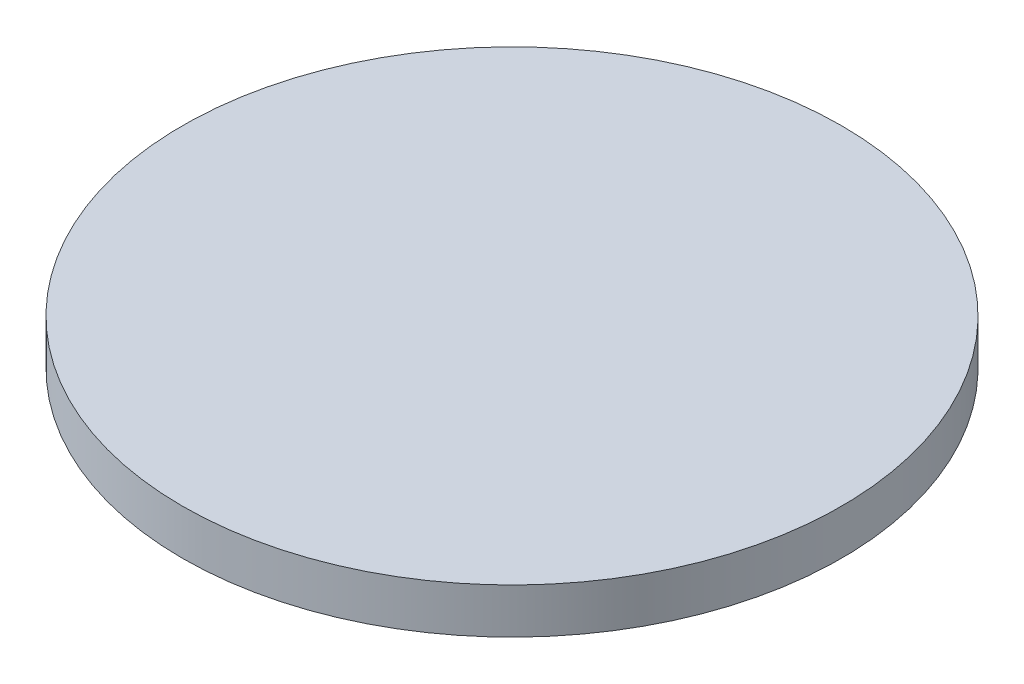
ISO-10303-21;
HEADER;
FILE_DESCRIPTION(('STEP AP214'),'2;1');
FILE_NAME('part.step','',(''),(''),'','','');
FILE_SCHEMA(('AUTOMOTIVE_DESIGN { 1 0 10303 214 1 1 1 1 }'));
ENDSEC;
DATA;
#1=APPLICATION_CONTEXT('core data for automotive mechanical design processes');
#2=APPLICATION_PROTOCOL_DEFINITION('international standard','automotive_design',2000,#1);
#3=PRODUCT_CONTEXT('',#1,'mechanical');
#4=PRODUCT('Part','Part','',(#3));
#5=PRODUCT_RELATED_PRODUCT_CATEGORY('part','',(#4));
#6=PRODUCT_DEFINITION_FORMATION('','',#4);
#7=PRODUCT_DEFINITION_CONTEXT('part definition',#1,'design');
#8=PRODUCT_DEFINITION('design','',#6,#7);
#9=PRODUCT_DEFINITION_SHAPE('','',#8);
#10=(LENGTH_UNIT() NAMED_UNIT(*) SI_UNIT(.MILLI.,.METRE.));
#11=(NAMED_UNIT(*) PLANE_ANGLE_UNIT() SI_UNIT($,.RADIAN.));
#12=(NAMED_UNIT(*) SI_UNIT($,.STERADIAN.) SOLID_ANGLE_UNIT());
#13=UNCERTAINTY_MEASURE_WITH_UNIT(LENGTH_MEASURE(1.E-05),#10,'distance_accuracy_value','');
#14=(GEOMETRIC_REPRESENTATION_CONTEXT(3) GLOBAL_UNCERTAINTY_ASSIGNED_CONTEXT((#13)) GLOBAL_UNIT_ASSIGNED_CONTEXT((#10,
#11,#12)) REPRESENTATION_CONTEXT('',''));
#15=CARTESIAN_POINT('',(0.,0.,0.));
#16=DIRECTION('',(0.,0.,1.));
#17=DIRECTION('',(1.,0.,0.));
#18=AXIS2_PLACEMENT_3D('',#15,#16,#17);
#19=CARTESIAN_POINT('',(0.,10.,0.));
#20=DIRECTION('',(0.,-1.,0.));
#21=DIRECTION('',(0.,0.,-1.));
#22=AXIS2_PLACEMENT_3D('',#19,#20,#21);
#23=CYLINDRICAL_SURFACE('',#22,72.95);
#24=CARTESIAN_POINT('',(0.,10.,0.));
#25=DIRECTION('',(0.,1.,0.));
#26=DIRECTION('',(0.,0.,1.));
#27=AXIS2_PLACEMENT_3D('',#24,#25,#26);
#28=CIRCLE('',#27,72.95);
#29=CARTESIAN_POINT('',(0.,10.,72.95));
#30=VERTEX_POINT('',#29);
#31=EDGE_CURVE('E10',#30,#30,#28,.T.);
#32=ORIENTED_EDGE('',*,*,#31,.F.);
#33=EDGE_LOOP('',(#32));
#34=FACE_BOUND('',#33,.T.);
#35=CARTESIAN_POINT('',(0.,0.,0.));
#36=DIRECTION('',(0.,1.,0.));
#37=DIRECTION('',(0.,0.,1.));
#38=AXIS2_PLACEMENT_3D('',#35,#36,#37);
#39=CIRCLE('',#38,72.95);
#40=CARTESIAN_POINT('',(0.,0.,72.95));
#41=VERTEX_POINT('',#40);
#42=EDGE_CURVE('E50',#41,#41,#39,.T.);
#43=ORIENTED_EDGE('',*,*,#42,.T.);
#44=EDGE_LOOP('',(#43));
#45=FACE_BOUND('',#44,.T.);
#46=ADVANCED_FACE('F47',(#34,#45),#23,.T.);
#47=CARTESIAN_POINT('',(0.,10.,0.));
#48=DIRECTION('',(0.,1.,0.));
#49=DIRECTION('',(0.,0.,1.));
#50=AXIS2_PLACEMENT_3D('',#47,#48,#49);
#51=PLANE('',#50);
#52=ORIENTED_EDGE('',*,*,#31,.T.);
#53=EDGE_LOOP('',(#52));
#54=FACE_BOUND('',#53,.T.);
#55=ADVANCED_FACE('F66',(#54),#51,.T.);
#56=CARTESIAN_POINT('',(0.,0.,0.));
#57=DIRECTION('',(0.,1.,0.));
#58=DIRECTION('',(0.,0.,1.));
#59=AXIS2_PLACEMENT_3D('',#56,#57,#58);
#60=PLANE('',#59);
#61=ORIENTED_EDGE('',*,*,#42,.F.);
#62=EDGE_LOOP('',(#61));
#63=FACE_BOUND('',#62,.T.);
#64=ADVANCED_FACE('F64',(#63),#60,.F.);
#65=CLOSED_SHELL('',(#46,#55,#64));
#66=MANIFOLD_SOLID_BREP('B2',#65);
#67=ADVANCED_BREP_SHAPE_REPRESENTATION('',(#18,#66),#14);
#68=SHAPE_DEFINITION_REPRESENTATION(#9,#67);
ENDSEC;
END-ISO-10303-21;
